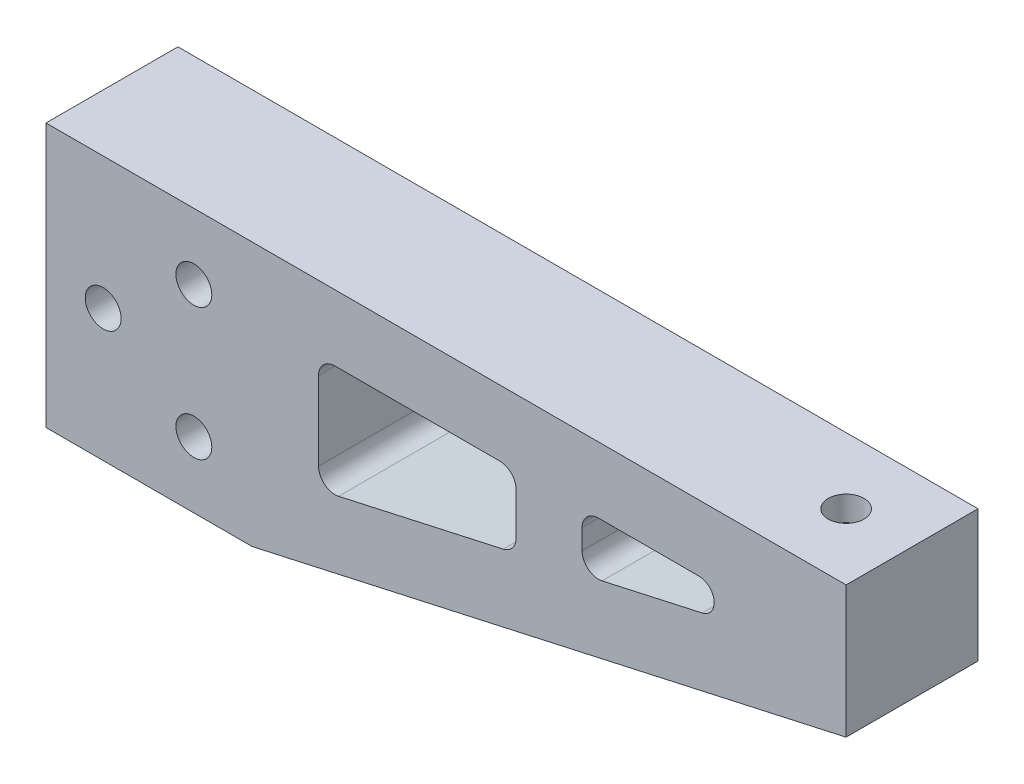
ISO-10303-21;
HEADER;
FILE_DESCRIPTION(('STEP AP214'),'2;1');
FILE_NAME('part.step','',(''),(''),'','','');
FILE_SCHEMA(('AUTOMOTIVE_DESIGN { 1 0 10303 214 1 1 1 1 }'));
ENDSEC;
DATA;
#1=APPLICATION_CONTEXT('core data for automotive mechanical design processes');
#2=APPLICATION_PROTOCOL_DEFINITION('international standard','automotive_design',2000,#1);
#3=PRODUCT_CONTEXT('',#1,'mechanical');
#4=PRODUCT('Part','Part','',(#3));
#5=PRODUCT_RELATED_PRODUCT_CATEGORY('part','',(#4));
#6=PRODUCT_DEFINITION_FORMATION('','',#4);
#7=PRODUCT_DEFINITION_CONTEXT('part definition',#1,'design');
#8=PRODUCT_DEFINITION('design','',#6,#7);
#9=PRODUCT_DEFINITION_SHAPE('','',#8);
#10=(LENGTH_UNIT() NAMED_UNIT(*) SI_UNIT(.MILLI.,.METRE.));
#11=(NAMED_UNIT(*) PLANE_ANGLE_UNIT() SI_UNIT($,.RADIAN.));
#12=(NAMED_UNIT(*) SI_UNIT($,.STERADIAN.) SOLID_ANGLE_UNIT());
#13=UNCERTAINTY_MEASURE_WITH_UNIT(LENGTH_MEASURE(1.E-05),#10,'distance_accuracy_value','');
#14=(GEOMETRIC_REPRESENTATION_CONTEXT(3) GLOBAL_UNCERTAINTY_ASSIGNED_CONTEXT((#13)) GLOBAL_UNIT_ASSIGNED_CONTEXT((#10,
#11,#12)) REPRESENTATION_CONTEXT('',''));
#15=CARTESIAN_POINT('',(0.,0.,0.));
#16=DIRECTION('',(0.,0.,1.));
#17=DIRECTION('',(1.,0.,0.));
#18=AXIS2_PLACEMENT_3D('',#15,#16,#17);
#19=CARTESIAN_POINT('',(-14.1787269469513,4.8712730530487,-6.35));
#20=DIRECTION('',(0.,0.,1.));
#21=DIRECTION('',(1.,0.,0.));
#22=AXIS2_PLACEMENT_3D('',#19,#20,#21);
#23=CYLINDRICAL_SURFACE('',#22,1.4787269469513);
#24=DIRECTION('',(0.,0.,-1.));
#25=VECTOR('',#24,1.);
#26=CARTESIAN_POINT('',(-14.1787269469513,6.35000000000001,-6.35));
#27=LINE('',#26,#25);
#28=CARTESIAN_POINT('',(-14.1787269469513,6.35000000000001,-6.35));
#29=VERTEX_POINT('',#28);
#30=CARTESIAN_POINT('',(-14.1787269469513,6.35000000000001,6.35));
#31=VERTEX_POINT('',#30);
#32=EDGE_CURVE('E298',#29,#31,#27,.F.);
#33=ORIENTED_EDGE('',*,*,#32,.F.);
#34=CARTESIAN_POINT('',(-14.1787269469513,4.8712730530487,-6.35));
#35=DIRECTION('',(0.,0.,-1.));
#36=DIRECTION('',(-1.,0.,0.));
#37=AXIS2_PLACEMENT_3D('',#34,#35,#36);
#38=CIRCLE('',#37,1.4787269469513);
#39=CARTESIAN_POINT('',(-13.8582107474269,3.42770014201083,-6.35));
#40=VERTEX_POINT('',#39);
#41=EDGE_CURVE('E47',#29,#40,#38,.T.);
#42=ORIENTED_EDGE('',*,*,#41,.T.);
#43=DIRECTION('',(0.,0.,-1.));
#44=VECTOR('',#43,1.);
#45=CARTESIAN_POINT('',(-13.8582107474269,3.42770014201083,-6.35));
#46=LINE('',#45,#44);
#47=CARTESIAN_POINT('',(-13.8582107474269,3.42770014201083,6.35));
#48=VERTEX_POINT('',#47);
#49=EDGE_CURVE('E301',#48,#40,#46,.T.);
#50=ORIENTED_EDGE('',*,*,#49,.F.);
#51=CARTESIAN_POINT('',(-14.1787269469513,4.8712730530487,6.35));
#52=DIRECTION('',(0.,0.,-1.));
#53=DIRECTION('',(-1.,0.,0.));
#54=AXIS2_PLACEMENT_3D('',#51,#52,#53);
#55=CIRCLE('',#54,1.4787269469513);
#56=EDGE_CURVE('E12',#48,#31,#55,.F.);
#57=ORIENTED_EDGE('',*,*,#56,.T.);
#58=EDGE_LOOP('',(#33,#42,#50,#57));
#59=FACE_BOUND('',#58,.T.);
#60=ADVANCED_FACE('F39',(#59),#23,.F.);
#61=CARTESIAN_POINT('',(0.,0.,-6.35));
#62=DIRECTION('',(0.,0.,-1.));
#63=DIRECTION('',(-1.,0.,0.));
#64=AXIS2_PLACEMENT_3D('',#61,#62,#63);
#65=PLANE('',#64);
#66=ORIENTED_EDGE('',*,*,#41,.F.);
#67=DIRECTION('',(-1.,0.,0.));
#68=VECTOR('',#67,1.);
#69=CARTESIAN_POINT('',(-25.424765,6.35000000000001,-6.35));
#70=LINE('',#69,#68);
#71=CARTESIAN_POINT('',(-23.837265,6.35000000000001,-6.35));
#72=VERTEX_POINT('',#71);
#73=EDGE_CURVE('E318',#29,#72,#70,.T.);
#74=ORIENTED_EDGE('',*,*,#73,.T.);
#75=CARTESIAN_POINT('',(-23.837265,4.76250000000001,-6.35));
#76=DIRECTION('',(0.,0.,-1.));
#77=DIRECTION('',(-1.,0.,0.));
#78=AXIS2_PLACEMENT_3D('',#75,#76,#77);
#79=CIRCLE('',#78,1.5875);
#80=CARTESIAN_POINT('',(-25.424765,4.76250000000001,-6.35));
#81=VERTEX_POINT('',#80);
#82=EDGE_CURVE('E292',#72,#81,#79,.F.);
#83=ORIENTED_EDGE('',*,*,#82,.T.);
#84=DIRECTION('',(0.,-1.,0.));
#85=VECTOR('',#84,1.);
#86=CARTESIAN_POINT('',(-25.424765,0.859580456277777,-6.35));
#87=LINE('',#86,#85);
#88=CARTESIAN_POINT('',(-25.424765,2.83821172123867,-6.35));
#89=VERTEX_POINT('',#88);
#90=EDGE_CURVE('E315',#81,#89,#87,.T.);
#91=ORIENTED_EDGE('',*,*,#90,.T.);
#92=CARTESIAN_POINT('',(-23.837265,2.83821172123867,-6.35));
#93=DIRECTION('',(0.,0.,-1.));
#94=DIRECTION('',(-1.,0.,0.));
#95=AXIS2_PLACEMENT_3D('',#92,#93,#94);
#96=CIRCLE('',#95,1.5875);
#97=CARTESIAN_POINT('',(-23.49317208427,1.28845163808243,-6.35));
#98=VERTEX_POINT('',#97);
#99=EDGE_CURVE('E296',#89,#98,#96,.F.);
#100=ORIENTED_EDGE('',*,*,#99,.T.);
#101=DIRECTION('',(0.976226824035428,0.216751442979513,0.));
#102=VECTOR('',#101,1.);
#103=CARTESIAN_POINT('',(-12.7,3.68485743844879,-6.35));
#104=LINE('',#103,#102);
#105=EDGE_CURVE('E307',#98,#40,#104,.T.);
#106=ORIENTED_EDGE('',*,*,#105,.T.);
#107=EDGE_LOOP('',(#66,#74,#83,#91,#100,#106));
#108=FACE_BOUND('',#107,.T.);
#109=DIRECTION('',(0.976226824035428,0.216751442979513,0.));
#110=VECTOR('',#109,1.);
#111=CARTESIAN_POINT('',(-31.774765,-0.55030875085382,-6.35));
#112=LINE('',#111,#110);
#113=CARTESIAN_POINT('',(-48.8699960050618,-4.34595941029603,-6.35));
#114=VERTEX_POINT('',#113);
#115=CARTESIAN_POINT('',(-33.01817208427,-0.826382172614966,-6.35));
#116=VERTEX_POINT('',#115);
#117=EDGE_CURVE('E325',#114,#116,#112,.T.);
#118=ORIENTED_EDGE('',*,*,#117,.T.);
#119=CARTESIAN_POINT('',(-33.362265,0.723377910541277,-6.35));
#120=DIRECTION('',(0.,0.,-1.));
#121=DIRECTION('',(-1.,0.,0.));
#122=AXIS2_PLACEMENT_3D('',#119,#120,#121);
#123=CIRCLE('',#122,1.5875);
#124=CARTESIAN_POINT('',(-31.774765,0.723377910541277,-6.35));
#125=VERTEX_POINT('',#124);
#126=EDGE_CURVE('E287',#116,#125,#123,.F.);
#127=ORIENTED_EDGE('',*,*,#126,.T.);
#128=DIRECTION('',(0.,1.,0.));
#129=VECTOR('',#128,1.);
#130=CARTESIAN_POINT('',(-31.774765,6.35000000000001,-6.35));
#131=LINE('',#130,#129);
#132=CARTESIAN_POINT('',(-31.774765,4.76250000000001,-6.35));
#133=VERTEX_POINT('',#132);
#134=EDGE_CURVE('E329',#125,#133,#131,.T.);
#135=ORIENTED_EDGE('',*,*,#134,.T.);
#136=CARTESIAN_POINT('',(-33.362265,4.76250000000001,-6.35));
#137=DIRECTION('',(0.,0.,-1.));
#138=DIRECTION('',(-1.,0.,0.));
#139=AXIS2_PLACEMENT_3D('',#136,#137,#138);
#140=CIRCLE('',#139,1.5875);
#141=CARTESIAN_POINT('',(-33.362265,6.35000000000001,-6.35));
#142=VERTEX_POINT('',#141);
#143=EDGE_CURVE('E283',#133,#142,#140,.F.);
#144=ORIENTED_EDGE('',*,*,#143,.T.);
#145=DIRECTION('',(-1.,0.,0.));
#146=VECTOR('',#145,1.);
#147=CARTESIAN_POINT('',(-50.8015889207918,6.35000000000001,-6.35));
#148=LINE('',#147,#146);
#149=CARTESIAN_POINT('',(-49.2140889207918,6.35000000000001,-6.35));
#150=VERTEX_POINT('',#149);
#151=EDGE_CURVE('E332',#142,#150,#148,.T.);
#152=ORIENTED_EDGE('',*,*,#151,.T.);
#153=CARTESIAN_POINT('',(-49.2140889207918,4.76250000000001,-6.35));
#154=DIRECTION('',(0.,0.,-1.));
#155=DIRECTION('',(-1.,0.,0.));
#156=AXIS2_PLACEMENT_3D('',#153,#154,#155);
#157=CIRCLE('',#156,1.5875);
#158=CARTESIAN_POINT('',(-50.8015889207918,4.76250000000001,-6.35));
#159=VERTEX_POINT('',#158);
#160=EDGE_CURVE('E279',#150,#159,#157,.F.);
#161=ORIENTED_EDGE('',*,*,#160,.T.);
#162=DIRECTION('',(0.,-1.,0.));
#163=VECTOR('',#162,1.);
#164=CARTESIAN_POINT('',(-50.8015889207918,-4.77483059210069,-6.35));
#165=LINE('',#164,#163);
#166=CARTESIAN_POINT('',(-50.8015889207918,-2.79619932713979,-6.35));
#167=VERTEX_POINT('',#166);
#168=EDGE_CURVE('E336',#159,#167,#165,.T.);
#169=ORIENTED_EDGE('',*,*,#168,.T.);
#170=CARTESIAN_POINT('',(-49.2140889207918,-2.79619932713979,-6.35));
#171=DIRECTION('',(0.,0.,-1.));
#172=DIRECTION('',(-1.,0.,0.));
#173=AXIS2_PLACEMENT_3D('',#170,#171,#172);
#174=CIRCLE('',#173,1.5875);
#175=EDGE_CURVE('E275',#167,#114,#174,.F.);
#176=ORIENTED_EDGE('',*,*,#175,.T.);
#177=EDGE_LOOP('',(#118,#127,#135,#144,#152,#161,#169,#176));
#178=FACE_BOUND('',#177,.T.);
#179=DIRECTION('',(0.976226824035428,0.216751442979513,0.));
#180=VECTOR('',#179,1.);
#181=CARTESIAN_POINT('',(-57.19953,-12.7,-6.35));
#182=LINE('',#181,#180);
#183=CARTESIAN_POINT('',(-57.19953,-12.7,-6.35));
#184=VERTEX_POINT('',#183);
#185=CARTESIAN_POINT('',(0.,0.,-6.35));
#186=VERTEX_POINT('',#185);
#187=EDGE_CURVE('E204',#184,#186,#182,.T.);
#188=ORIENTED_EDGE('',*,*,#187,.F.);
#189=DIRECTION('',(1.,0.,0.));
#190=VECTOR('',#189,1.);
#191=CARTESIAN_POINT('',(0.,-12.7,-6.35));
#192=LINE('',#191,#190);
#193=CARTESIAN_POINT('',(-77.04328,-12.7,-6.35));
#194=VERTEX_POINT('',#193);
#195=EDGE_CURVE('E213',#194,#184,#192,.T.);
#196=ORIENTED_EDGE('',*,*,#195,.F.);
#197=DIRECTION('',(0.,-1.,0.));
#198=VECTOR('',#197,1.);
#199=CARTESIAN_POINT('',(-77.04328,12.7,-6.35));
#200=LINE('',#199,#198);
#201=CARTESIAN_POINT('',(-77.04328,12.7,-6.35));
#202=VERTEX_POINT('',#201);
#203=EDGE_CURVE('E233',#202,#194,#200,.T.);
#204=ORIENTED_EDGE('',*,*,#203,.F.);
#205=DIRECTION('',(-1.,0.,0.));
#206=VECTOR('',#205,1.);
#207=CARTESIAN_POINT('',(0.,12.7,-6.35));
#208=LINE('',#207,#206);
#209=CARTESIAN_POINT('',(0.,12.7,-6.35));
#210=VERTEX_POINT('',#209);
#211=EDGE_CURVE('E230',#210,#202,#208,.T.);
#212=ORIENTED_EDGE('',*,*,#211,.F.);
#213=DIRECTION('',(0.,1.,0.));
#214=VECTOR('',#213,1.);
#215=CARTESIAN_POINT('',(0.,12.7,-6.35));
#216=LINE('',#215,#214);
#217=EDGE_CURVE('E228',#186,#210,#216,.T.);
#218=ORIENTED_EDGE('',*,*,#217,.F.);
#219=EDGE_LOOP('',(#188,#196,#204,#212,#218));
#220=FACE_BOUND('',#219,.T.);
#221=CARTESIAN_POINT('',(-62.80658,-6.35000000000018,-6.35));
#222=DIRECTION('',(0.,0.,1.));
#223=DIRECTION('',(1.,0.,0.));
#224=AXIS2_PLACEMENT_3D('',#221,#222,#223);
#225=CIRCLE('',#224,1.7272);
#226=CARTESIAN_POINT('',(-61.07938,-6.35000000000018,-6.35));
#227=VERTEX_POINT('',#226);
#228=EDGE_CURVE('E355',#227,#227,#225,.T.);
#229=ORIENTED_EDGE('',*,*,#228,.T.);
#230=EDGE_LOOP('',(#229));
#231=FACE_BOUND('',#230,.T.);
#232=CARTESIAN_POINT('',(-71.53783,-1.50617572273387E-13,-6.35));
#233=DIRECTION('',(0.,0.,1.));
#234=DIRECTION('',(1.,0.,0.));
#235=AXIS2_PLACEMENT_3D('',#232,#233,#234);
#236=CIRCLE('',#235,1.7272);
#237=CARTESIAN_POINT('',(-69.81063,-1.50617572273387E-13,-6.35));
#238=VERTEX_POINT('',#237);
#239=EDGE_CURVE('E361',#238,#238,#236,.T.);
#240=ORIENTED_EDGE('',*,*,#239,.T.);
#241=EDGE_LOOP('',(#240));
#242=FACE_BOUND('',#241,.T.);
#243=CARTESIAN_POINT('',(-62.80658,6.34999999999982,-6.35));
#244=DIRECTION('',(0.,0.,1.));
#245=DIRECTION('',(1.,0.,0.));
#246=AXIS2_PLACEMENT_3D('',#243,#244,#245);
#247=CIRCLE('',#246,1.7272);
#248=CARTESIAN_POINT('',(-61.07938,6.34999999999982,-6.35));
#249=VERTEX_POINT('',#248);
#250=EDGE_CURVE('E367',#249,#249,#247,.T.);
#251=ORIENTED_EDGE('',*,*,#250,.T.);
#252=EDGE_LOOP('',(#251));
#253=FACE_BOUND('',#252,.T.);
#254=ADVANCED_FACE('F311',(#108,#178,#220,#231,#242,#253),#65,.T.);
#255=CARTESIAN_POINT('',(-9.29875019919063,8.14235000000001,2.94874980080985));
#256=DIRECTION('',(-1.,0.,0.));
#257=DIRECTION('',(0.,-1.,0.));
#258=AXIS2_PLACEMENT_3D('',#255,#256,#257);
#259=PLANE('',#258);
#260=DIRECTION('',(0.,0.,1.));
#261=VECTOR('',#260,1.);
#262=CARTESIAN_POINT('',(-9.29875019919063,10.31875,2.94874980080985));
#263=LINE('',#262,#261);
#264=CARTESIAN_POINT('',(-9.29875019919063,10.31875,-2.94875019919014));
#265=VERTEX_POINT('',#264);
#266=CARTESIAN_POINT('',(-9.29875019919063,10.31875,2.94874980080985));
#267=VERTEX_POINT('',#266);
#268=EDGE_CURVE('E382',#265,#267,#263,.T.);
#269=ORIENTED_EDGE('',*,*,#268,.T.);
#270=DIRECTION('',(0.,1.,0.));
#271=VECTOR('',#270,1.);
#272=CARTESIAN_POINT('',(-9.29875019919063,8.14235000000001,2.94874980080985));
#273=LINE('',#272,#271);
#274=CARTESIAN_POINT('',(-9.29875019919063,8.14235000000001,2.94874980080985));
#275=VERTEX_POINT('',#274);
#276=EDGE_CURVE('E396',#275,#267,#273,.T.);
#277=ORIENTED_EDGE('',*,*,#276,.F.);
#278=DIRECTION('',(0.,0.,1.));
#279=VECTOR('',#278,1.);
#280=CARTESIAN_POINT('',(-9.29875019919063,8.14235000000001,2.94874980080985));
#281=LINE('',#280,#279);
#282=CARTESIAN_POINT('',(-9.29875019919063,8.14235000000001,-2.94875019919014));
#283=VERTEX_POINT('',#282);
#284=EDGE_CURVE('E383',#283,#275,#281,.T.);
#285=ORIENTED_EDGE('',*,*,#284,.F.);
#286=DIRECTION('',(0.,1.,0.));
#287=VECTOR('',#286,1.);
#288=CARTESIAN_POINT('',(-9.29875019919063,8.14235000000001,-2.94875019919014));
#289=LINE('',#288,#287);
#290=EDGE_CURVE('E231',#283,#265,#289,.T.);
#291=ORIENTED_EDGE('',*,*,#290,.T.);
#292=EDGE_LOOP('',(#269,#277,#285,#291));
#293=FACE_BOUND('',#292,.T.);
#294=ADVANCED_FACE('F445',(#293),#259,.F.);
#295=CARTESIAN_POINT('',(-3.40125019919063,8.14235000000001,-2.94875019919015));
#296=DIRECTION('',(0.,0.,-1.));
#297=DIRECTION('',(-1.,0.,0.));
#298=AXIS2_PLACEMENT_3D('',#295,#296,#297);
#299=PLANE('',#298);
#300=DIRECTION('',(-1.,0.,0.));
#301=VECTOR('',#300,1.);
#302=CARTESIAN_POINT('',(-3.40125019919063,10.31875,-2.94875019919015));
#303=LINE('',#302,#301);
#304=CARTESIAN_POINT('',(-3.40125019919063,10.31875,-2.94875019919015));
#305=VERTEX_POINT('',#304);
#306=EDGE_CURVE('E387',#305,#265,#303,.T.);
#307=ORIENTED_EDGE('',*,*,#306,.T.);
#308=ORIENTED_EDGE('',*,*,#290,.F.);
#309=DIRECTION('',(-1.,0.,0.));
#310=VECTOR('',#309,1.);
#311=CARTESIAN_POINT('',(-3.40125019919063,8.14235000000001,-2.94875019919015));
#312=LINE('',#311,#310);
#313=CARTESIAN_POINT('',(-3.40125019919063,8.14235000000001,-2.94875019919015));
#314=VERTEX_POINT('',#313);
#315=EDGE_CURVE('E393',#314,#283,#312,.T.);
#316=ORIENTED_EDGE('',*,*,#315,.F.);
#317=DIRECTION('',(0.,1.,0.));
#318=VECTOR('',#317,1.);
#319=CARTESIAN_POINT('',(-3.40125019919063,8.14235000000001,-2.94875019919015));
#320=LINE('',#319,#318);
#321=EDGE_CURVE('E408',#314,#305,#320,.T.);
#322=ORIENTED_EDGE('',*,*,#321,.T.);
#323=EDGE_LOOP('',(#307,#308,#316,#322));
#324=FACE_BOUND('',#323,.T.);
#325=ADVANCED_FACE('F550',(#324),#299,.F.);
#326=CARTESIAN_POINT('',(-3.40125019919063,8.14235000000001,2.94874980080985));
#327=DIRECTION('',(1.,0.,0.));
#328=DIRECTION('',(0.,1.,0.));
#329=AXIS2_PLACEMENT_3D('',#326,#327,#328);
#330=PLANE('',#329);
#331=DIRECTION('',(0.,0.,-1.));
#332=VECTOR('',#331,1.);
#333=CARTESIAN_POINT('',(-3.40125019919063,10.31875,2.94874980080985));
#334=LINE('',#333,#332);
#335=CARTESIAN_POINT('',(-3.40125019919063,10.31875,2.94874980080985));
#336=VERTEX_POINT('',#335);
#337=EDGE_CURVE('E402',#336,#305,#334,.T.);
#338=ORIENTED_EDGE('',*,*,#337,.T.);
#339=ORIENTED_EDGE('',*,*,#321,.F.);
#340=DIRECTION('',(0.,0.,-1.));
#341=VECTOR('',#340,1.);
#342=CARTESIAN_POINT('',(-3.40125019919063,8.14235000000001,2.94874980080985));
#343=LINE('',#342,#341);
#344=CARTESIAN_POINT('',(-3.40125019919063,8.14235000000001,2.94874980080985));
#345=VERTEX_POINT('',#344);
#346=EDGE_CURVE('E390',#345,#314,#343,.T.);
#347=ORIENTED_EDGE('',*,*,#346,.F.);
#348=DIRECTION('',(0.,1.,0.));
#349=VECTOR('',#348,1.);
#350=CARTESIAN_POINT('',(-3.40125019919063,8.14235000000001,2.94874980080985));
#351=LINE('',#350,#349);
#352=EDGE_CURVE('E410',#345,#336,#351,.T.);
#353=ORIENTED_EDGE('',*,*,#352,.T.);
#354=EDGE_LOOP('',(#338,#339,#347,#353));
#355=FACE_BOUND('',#354,.T.);
#356=ADVANCED_FACE('F553',(#355),#330,.F.);
#357=CARTESIAN_POINT('',(-3.40125019919063,8.14235000000001,2.94874980080985));
#358=DIRECTION('',(0.,0.,1.));
#359=DIRECTION('',(1.,0.,0.));
#360=AXIS2_PLACEMENT_3D('',#357,#358,#359);
#361=PLANE('',#360);
#362=DIRECTION('',(1.,0.,0.));
#363=VECTOR('',#362,1.);
#364=CARTESIAN_POINT('',(-3.40125019919063,10.31875,2.94874980080985));
#365=LINE('',#364,#363);
#366=EDGE_CURVE('E399',#267,#336,#365,.T.);
#367=ORIENTED_EDGE('',*,*,#366,.T.);
#368=ORIENTED_EDGE('',*,*,#352,.F.);
#369=DIRECTION('',(1.,0.,0.));
#370=VECTOR('',#369,1.);
#371=CARTESIAN_POINT('',(-3.40125019919063,8.14235000000001,2.94874980080985));
#372=LINE('',#371,#370);
#373=EDGE_CURVE('E386',#275,#345,#372,.T.);
#374=ORIENTED_EDGE('',*,*,#373,.F.);
#375=ORIENTED_EDGE('',*,*,#276,.T.);
#376=EDGE_LOOP('',(#367,#368,#374,#375));
#377=FACE_BOUND('',#376,.T.);
#378=ADVANCED_FACE('F545',(#377),#361,.F.);
#379=CARTESIAN_POINT('',(0.,8.14235000000001,0.));
#380=DIRECTION('',(0.,1.,0.));
#381=DIRECTION('',(0.,0.,1.));
#382=AXIS2_PLACEMENT_3D('',#379,#380,#381);
#383=PLANE('',#382);
#384=CARTESIAN_POINT('',(-6.35000019919064,8.14235000000001,-1.99190244151715E-07));
#385=DIRECTION('',(0.,1.,0.));
#386=DIRECTION('',(0.,0.,1.));
#387=AXIS2_PLACEMENT_3D('',#384,#385,#386);
#388=CIRCLE('',#387,1.7272);
#389=CARTESIAN_POINT('',(-6.35000019919064,8.14235000000001,1.72719980080976));
#390=VERTEX_POINT('',#389);
#391=EDGE_CURVE('E379',#390,#390,#388,.T.);
#392=ORIENTED_EDGE('',*,*,#391,.F.);
#393=EDGE_LOOP('',(#392));
#394=FACE_BOUND('',#393,.T.);
#395=ORIENTED_EDGE('',*,*,#284,.T.);
#396=ORIENTED_EDGE('',*,*,#373,.T.);
#397=ORIENTED_EDGE('',*,*,#346,.T.);
#398=ORIENTED_EDGE('',*,*,#315,.T.);
#399=EDGE_LOOP('',(#395,#396,#397,#398));
#400=FACE_BOUND('',#399,.T.);
#401=ADVANCED_FACE('F541',(#394,#400),#383,.T.);
#402=CARTESIAN_POINT('',(0.,10.31875,0.));
#403=DIRECTION('',(0.,1.,0.));
#404=DIRECTION('',(0.,0.,1.));
#405=AXIS2_PLACEMENT_3D('',#402,#403,#404);
#406=PLANE('',#405);
#407=CARTESIAN_POINT('',(-6.35000019919064,10.31875,-1.99190244151715E-07));
#408=DIRECTION('',(0.,1.,0.));
#409=DIRECTION('',(0.,0.,1.));
#410=AXIS2_PLACEMENT_3D('',#407,#408,#409);
#411=CIRCLE('',#410,1.7272);
#412=CARTESIAN_POINT('',(-6.35000019919064,10.31875,1.72719980080976));
#413=VERTEX_POINT('',#412);
#414=EDGE_CURVE('E376',#413,#413,#411,.T.);
#415=ORIENTED_EDGE('',*,*,#414,.T.);
#416=EDGE_LOOP('',(#415));
#417=FACE_BOUND('',#416,.T.);
#418=ORIENTED_EDGE('',*,*,#268,.F.);
#419=ORIENTED_EDGE('',*,*,#306,.F.);
#420=ORIENTED_EDGE('',*,*,#337,.F.);
#421=ORIENTED_EDGE('',*,*,#366,.F.);
#422=EDGE_LOOP('',(#418,#419,#420,#421));
#423=FACE_BOUND('',#422,.T.);
#424=ADVANCED_FACE('F544',(#417,#423),#406,.F.);
#425=CARTESIAN_POINT('',(-6.35000019919064,12.7,-1.99190244151715E-07));
#426=DIRECTION('',(0.,1.,0.));
#427=DIRECTION('',(0.,0.,1.));
#428=AXIS2_PLACEMENT_3D('',#425,#426,#427);
#429=CYLINDRICAL_SURFACE('',#428,1.7272);
#430=CARTESIAN_POINT('',(-6.35000019919064,12.7,-1.99190244151715E-07));
#431=DIRECTION('',(0.,1.,0.));
#432=DIRECTION('',(0.,0.,1.));
#433=AXIS2_PLACEMENT_3D('',#430,#431,#432);
#434=CIRCLE('',#433,1.7272);
#435=CARTESIAN_POINT('',(-6.35000019919064,12.7,1.72719980080976));
#436=VERTEX_POINT('',#435);
#437=EDGE_CURVE('E370',#436,#436,#434,.T.);
#438=ORIENTED_EDGE('',*,*,#437,.T.);
#439=EDGE_LOOP('',(#438));
#440=FACE_BOUND('',#439,.T.);
#441=ORIENTED_EDGE('',*,*,#414,.F.);
#442=EDGE_LOOP('',(#441));
#443=FACE_BOUND('',#442,.T.);
#444=ADVANCED_FACE('F439',(#440,#443),#429,.F.);
#445=CARTESIAN_POINT('',(-6.35000019919064,6.35000000000001,-1.99190244151715E-07));
#446=DIRECTION('',(0.,1.,0.));
#447=DIRECTION('',(0.,0.,1.));
#448=AXIS2_PLACEMENT_3D('',#445,#446,#447);
#449=CONICAL_SURFACE('',#448,1.7272,1.02974425867665);
#450=CARTESIAN_POINT('',(-6.35000019919064,5.3121935388156,-1.99190244151715E-07));
#451=VERTEX_POINT('',#450);
#452=VERTEX_LOOP('',#451);
#453=FACE_BOUND('',#452,.T.);
#454=CARTESIAN_POINT('',(-6.35000019919064,6.35000000000001,-1.99190244151715E-07));
#455=DIRECTION('',(0.,1.,0.));
#456=DIRECTION('',(0.,0.,1.));
#457=AXIS2_PLACEMENT_3D('',#454,#455,#456);
#458=CIRCLE('',#457,1.7272);
#459=CARTESIAN_POINT('',(-6.35000019919064,6.35000000000001,1.72719980080975));
#460=VERTEX_POINT('',#459);
#461=EDGE_CURVE('E373',#460,#460,#458,.T.);
#462=ORIENTED_EDGE('',*,*,#461,.T.);
#463=EDGE_LOOP('',(#462));
#464=FACE_BOUND('',#463,.T.);
#465=ADVANCED_FACE('F436',(#453,#464),#449,.F.);
#466=ORIENTED_EDGE('',*,*,#391,.T.);
#467=EDGE_LOOP('',(#466));
#468=FACE_BOUND('',#467,.T.);
#469=ORIENTED_EDGE('',*,*,#461,.F.);
#470=EDGE_LOOP('',(#469));
#471=FACE_BOUND('',#470,.T.);
#472=ADVANCED_FACE('F428',(#468,#471),#429,.F.);
#473=CARTESIAN_POINT('',(0.,12.7,6.35));
#474=DIRECTION('',(-1.,0.,0.));
#475=DIRECTION('',(0.,-1.,0.));
#476=AXIS2_PLACEMENT_3D('',#473,#474,#475);
#477=PLANE('',#476);
#478=DIRECTION('',(0.,1.,0.));
#479=VECTOR('',#478,1.);
#480=CARTESIAN_POINT('',(0.,12.7,6.35));
#481=LINE('',#480,#479);
#482=CARTESIAN_POINT('',(0.,0.,6.35));
#483=VERTEX_POINT('',#482);
#484=CARTESIAN_POINT('',(0.,12.7,6.35));
#485=VERTEX_POINT('',#484);
#486=EDGE_CURVE('E235',#483,#485,#481,.T.);
#487=ORIENTED_EDGE('',*,*,#486,.F.);
#488=DIRECTION('',(0.,0.,-1.));
#489=VECTOR('',#488,1.);
#490=CARTESIAN_POINT('',(0.,0.,6.35));
#491=LINE('',#490,#489);
#492=EDGE_CURVE('E200',#483,#186,#491,.T.);
#493=ORIENTED_EDGE('',*,*,#492,.T.);
#494=ORIENTED_EDGE('',*,*,#217,.T.);
#495=DIRECTION('',(0.,0.,-1.));
#496=VECTOR('',#495,1.);
#497=CARTESIAN_POINT('',(0.,12.7,6.35));
#498=LINE('',#497,#496);
#499=EDGE_CURVE('E239',#485,#210,#498,.T.);
#500=ORIENTED_EDGE('',*,*,#499,.F.);
#501=EDGE_LOOP('',(#487,#493,#494,#500));
#502=FACE_BOUND('',#501,.T.);
#503=ADVANCED_FACE('F426',(#502),#477,.F.);
#504=CARTESIAN_POINT('',(0.,12.7,6.35));
#505=DIRECTION('',(0.,-1.,0.));
#506=DIRECTION('',(1.,0.,0.));
#507=AXIS2_PLACEMENT_3D('',#504,#505,#506);
#508=PLANE('',#507);
#509=ORIENTED_EDGE('',*,*,#437,.F.);
#510=EDGE_LOOP('',(#509));
#511=FACE_BOUND('',#510,.T.);
#512=ORIENTED_EDGE('',*,*,#211,.T.);
#513=DIRECTION('',(0.,0.,-1.));
#514=VECTOR('',#513,1.);
#515=CARTESIAN_POINT('',(-77.04328,12.7,6.35));
#516=LINE('',#515,#514);
#517=CARTESIAN_POINT('',(-77.04328,12.7,6.35));
#518=VERTEX_POINT('',#517);
#519=EDGE_CURVE('E222',#518,#202,#516,.T.);
#520=ORIENTED_EDGE('',*,*,#519,.F.);
#521=DIRECTION('',(-1.,0.,0.));
#522=VECTOR('',#521,1.);
#523=CARTESIAN_POINT('',(0.,12.7,6.35));
#524=LINE('',#523,#522);
#525=EDGE_CURVE('E224',#485,#518,#524,.T.);
#526=ORIENTED_EDGE('',*,*,#525,.F.);
#527=ORIENTED_EDGE('',*,*,#499,.T.);
#528=EDGE_LOOP('',(#512,#520,#526,#527));
#529=FACE_BOUND('',#528,.T.);
#530=ADVANCED_FACE('F417',(#511,#529),#508,.F.);
#531=CARTESIAN_POINT('',(-77.04328,12.7,6.35));
#532=DIRECTION('',(1.,0.,0.));
#533=DIRECTION('',(0.,0.,-1.));
#534=AXIS2_PLACEMENT_3D('',#531,#532,#533);
#535=PLANE('',#534);
#536=ORIENTED_EDGE('',*,*,#203,.T.);
#537=DIRECTION('',(0.,0.,-1.));
#538=VECTOR('',#537,1.);
#539=CARTESIAN_POINT('',(-77.04328,-12.7,6.35));
#540=LINE('',#539,#538);
#541=CARTESIAN_POINT('',(-77.04328,-12.7,6.35));
#542=VERTEX_POINT('',#541);
#543=EDGE_CURVE('E220',#542,#194,#540,.T.);
#544=ORIENTED_EDGE('',*,*,#543,.F.);
#545=DIRECTION('',(0.,-1.,0.));
#546=VECTOR('',#545,1.);
#547=CARTESIAN_POINT('',(-77.04328,12.7,6.35));
#548=LINE('',#547,#546);
#549=EDGE_CURVE('E218',#518,#542,#548,.T.);
#550=ORIENTED_EDGE('',*,*,#549,.F.);
#551=ORIENTED_EDGE('',*,*,#519,.T.);
#552=EDGE_LOOP('',(#536,#544,#550,#551));
#553=FACE_BOUND('',#552,.T.);
#554=ADVANCED_FACE('F421',(#553),#535,.F.);
#555=CARTESIAN_POINT('',(0.,-12.7,6.35));
#556=DIRECTION('',(0.,1.,0.));
#557=DIRECTION('',(-1.,0.,0.));
#558=AXIS2_PLACEMENT_3D('',#555,#556,#557);
#559=PLANE('',#558);
#560=ORIENTED_EDGE('',*,*,#195,.T.);
#561=DIRECTION('',(0.,0.,-1.));
#562=VECTOR('',#561,1.);
#563=CARTESIAN_POINT('',(-57.19953,-12.7,6.35));
#564=LINE('',#563,#562);
#565=CARTESIAN_POINT('',(-57.19953,-12.7,6.35));
#566=VERTEX_POINT('',#565);
#567=EDGE_CURVE('E197',#566,#184,#564,.T.);
#568=ORIENTED_EDGE('',*,*,#567,.F.);
#569=DIRECTION('',(1.,0.,0.));
#570=VECTOR('',#569,1.);
#571=CARTESIAN_POINT('',(0.,-12.7,6.35));
#572=LINE('',#571,#570);
#573=EDGE_CURVE('E211',#542,#566,#572,.T.);
#574=ORIENTED_EDGE('',*,*,#573,.F.);
#575=ORIENTED_EDGE('',*,*,#543,.T.);
#576=EDGE_LOOP('',(#560,#568,#574,#575));
#577=FACE_BOUND('',#576,.T.);
#578=ADVANCED_FACE('F209',(#577),#559,.F.);
#579=CARTESIAN_POINT('',(0.,0.,6.35));
#580=DIRECTION('',(0.,0.,-1.));
#581=DIRECTION('',(-1.,0.,0.));
#582=AXIS2_PLACEMENT_3D('',#579,#580,#581);
#583=PLANE('',#582);
#584=DIRECTION('',(-1.,0.,0.));
#585=VECTOR('',#584,1.);
#586=CARTESIAN_POINT('',(-25.424765,6.35000000000001,6.35));
#587=LINE('',#586,#585);
#588=CARTESIAN_POINT('',(-23.837265,6.35000000000001,6.35));
#589=VERTEX_POINT('',#588);
#590=EDGE_CURVE('E322',#31,#589,#587,.T.);
#591=ORIENTED_EDGE('',*,*,#590,.F.);
#592=ORIENTED_EDGE('',*,*,#56,.F.);
#593=DIRECTION('',(0.976226824035428,0.216751442979513,0.));
#594=VECTOR('',#593,1.);
#595=CARTESIAN_POINT('',(-12.7,3.68485743844879,6.35));
#596=LINE('',#595,#594);
#597=CARTESIAN_POINT('',(-23.49317208427,1.28845163808243,6.35));
#598=VERTEX_POINT('',#597);
#599=EDGE_CURVE('E309',#598,#48,#596,.T.);
#600=ORIENTED_EDGE('',*,*,#599,.F.);
#601=CARTESIAN_POINT('',(-23.837265,2.83821172123867,6.35));
#602=DIRECTION('',(0.,0.,-1.));
#603=DIRECTION('',(-1.,0.,0.));
#604=AXIS2_PLACEMENT_3D('',#601,#602,#603);
#605=CIRCLE('',#604,1.5875);
#606=CARTESIAN_POINT('',(-25.424765,2.83821172123867,6.35));
#607=VERTEX_POINT('',#606);
#608=EDGE_CURVE('E294',#598,#607,#605,.T.);
#609=ORIENTED_EDGE('',*,*,#608,.T.);
#610=DIRECTION('',(0.,-1.,0.));
#611=VECTOR('',#610,1.);
#612=CARTESIAN_POINT('',(-25.424765,0.859580456277777,6.35));
#613=LINE('',#612,#611);
#614=CARTESIAN_POINT('',(-25.424765,4.76250000000001,6.35));
#615=VERTEX_POINT('',#614);
#616=EDGE_CURVE('E324',#615,#607,#613,.T.);
#617=ORIENTED_EDGE('',*,*,#616,.F.);
#618=CARTESIAN_POINT('',(-23.837265,4.76250000000001,6.35));
#619=DIRECTION('',(0.,0.,-1.));
#620=DIRECTION('',(-1.,0.,0.));
#621=AXIS2_PLACEMENT_3D('',#618,#619,#620);
#622=CIRCLE('',#621,1.5875);
#623=EDGE_CURVE('E289',#615,#589,#622,.T.);
#624=ORIENTED_EDGE('',*,*,#623,.T.);
#625=EDGE_LOOP('',(#591,#592,#600,#609,#617,#624));
#626=FACE_BOUND('',#625,.T.);
#627=DIRECTION('',(-1.,0.,0.));
#628=VECTOR('',#627,1.);
#629=CARTESIAN_POINT('',(-50.8015889207918,6.35000000000001,6.35));
#630=LINE('',#629,#628);
#631=CARTESIAN_POINT('',(-33.362265,6.35000000000001,6.35));
#632=VERTEX_POINT('',#631);
#633=CARTESIAN_POINT('',(-49.2140889207918,6.35000000000001,6.35));
#634=VERTEX_POINT('',#633);
#635=EDGE_CURVE('E344',#632,#634,#630,.T.);
#636=ORIENTED_EDGE('',*,*,#635,.F.);
#637=CARTESIAN_POINT('',(-33.362265,4.76250000000001,6.35));
#638=DIRECTION('',(0.,0.,-1.));
#639=DIRECTION('',(-1.,0.,0.));
#640=AXIS2_PLACEMENT_3D('',#637,#638,#639);
#641=CIRCLE('',#640,1.5875);
#642=CARTESIAN_POINT('',(-31.774765,4.76250000000001,6.35));
#643=VERTEX_POINT('',#642);
#644=EDGE_CURVE('E281',#632,#643,#641,.T.);
#645=ORIENTED_EDGE('',*,*,#644,.T.);
#646=DIRECTION('',(0.,1.,0.));
#647=VECTOR('',#646,1.);
#648=CARTESIAN_POINT('',(-31.774765,6.35000000000001,6.35));
#649=LINE('',#648,#647);
#650=CARTESIAN_POINT('',(-31.774765,0.723377910541277,6.35));
#651=VERTEX_POINT('',#650);
#652=EDGE_CURVE('E341',#651,#643,#649,.T.);
#653=ORIENTED_EDGE('',*,*,#652,.F.);
#654=CARTESIAN_POINT('',(-33.362265,0.723377910541277,6.35));
#655=DIRECTION('',(0.,0.,-1.));
#656=DIRECTION('',(-1.,0.,0.));
#657=AXIS2_PLACEMENT_3D('',#654,#655,#656);
#658=CIRCLE('',#657,1.5875);
#659=CARTESIAN_POINT('',(-33.01817208427,-0.826382172614966,6.35));
#660=VERTEX_POINT('',#659);
#661=EDGE_CURVE('E285',#651,#660,#658,.T.);
#662=ORIENTED_EDGE('',*,*,#661,.T.);
#663=DIRECTION('',(0.976226824035428,0.216751442979513,0.));
#664=VECTOR('',#663,1.);
#665=CARTESIAN_POINT('',(-31.774765,-0.55030875085382,6.35));
#666=LINE('',#665,#664);
#667=CARTESIAN_POINT('',(-48.8699960050618,-4.34595941029603,6.35));
#668=VERTEX_POINT('',#667);
#669=EDGE_CURVE('E333',#668,#660,#666,.T.);
#670=ORIENTED_EDGE('',*,*,#669,.F.);
#671=CARTESIAN_POINT('',(-49.2140889207918,-2.79619932713979,6.35));
#672=DIRECTION('',(0.,0.,-1.));
#673=DIRECTION('',(-1.,0.,0.));
#674=AXIS2_PLACEMENT_3D('',#671,#672,#673);
#675=CIRCLE('',#674,1.5875);
#676=CARTESIAN_POINT('',(-50.8015889207918,-2.79619932713979,6.35));
#677=VERTEX_POINT('',#676);
#678=EDGE_CURVE('E273',#668,#677,#675,.T.);
#679=ORIENTED_EDGE('',*,*,#678,.T.);
#680=DIRECTION('',(0.,-1.,0.));
#681=VECTOR('',#680,1.);
#682=CARTESIAN_POINT('',(-50.8015889207918,-4.77483059210069,6.35));
#683=LINE('',#682,#681);
#684=CARTESIAN_POINT('',(-50.8015889207918,4.76250000000001,6.35));
#685=VERTEX_POINT('',#684);
#686=EDGE_CURVE('E347',#685,#677,#683,.T.);
#687=ORIENTED_EDGE('',*,*,#686,.F.);
#688=CARTESIAN_POINT('',(-49.2140889207918,4.76250000000001,6.35));
#689=DIRECTION('',(0.,0.,-1.));
#690=DIRECTION('',(-1.,0.,0.));
#691=AXIS2_PLACEMENT_3D('',#688,#689,#690);
#692=CIRCLE('',#691,1.5875);
#693=EDGE_CURVE('E277',#685,#634,#692,.T.);
#694=ORIENTED_EDGE('',*,*,#693,.T.);
#695=EDGE_LOOP('',(#636,#645,#653,#662,#670,#679,#687,#694));
#696=FACE_BOUND('',#695,.T.);
#697=CARTESIAN_POINT('',(-62.80658,-6.35000000000018,6.35));
#698=DIRECTION('',(0.,0.,1.));
#699=DIRECTION('',(1.,0.,0.));
#700=AXIS2_PLACEMENT_3D('',#697,#698,#699);
#701=CIRCLE('',#700,1.72719999999998);
#702=CARTESIAN_POINT('',(-61.07938,-6.35000000000018,6.35));
#703=VERTEX_POINT('',#702);
#704=EDGE_CURVE('E214',#703,#703,#701,.T.);
#705=ORIENTED_EDGE('',*,*,#704,.F.);
#706=EDGE_LOOP('',(#705));
#707=FACE_BOUND('',#706,.T.);
#708=CARTESIAN_POINT('',(-71.53783,-1.50617572273387E-13,6.35));
#709=DIRECTION('',(0.,0.,1.));
#710=DIRECTION('',(1.,0.,0.));
#711=AXIS2_PLACEMENT_3D('',#708,#709,#710);
#712=CIRCLE('',#711,1.72719999999998);
#713=CARTESIAN_POINT('',(-69.81063,-1.50617572273387E-13,6.35));
#714=VERTEX_POINT('',#713);
#715=EDGE_CURVE('E358',#714,#714,#712,.T.);
#716=ORIENTED_EDGE('',*,*,#715,.F.);
#717=EDGE_LOOP('',(#716));
#718=FACE_BOUND('',#717,.T.);
#719=CARTESIAN_POINT('',(-62.80658,6.34999999999982,6.35));
#720=DIRECTION('',(0.,0.,1.));
#721=DIRECTION('',(1.,0.,0.));
#722=AXIS2_PLACEMENT_3D('',#719,#720,#721);
#723=CIRCLE('',#722,1.72719999999998);
#724=CARTESIAN_POINT('',(-61.07938,6.34999999999982,6.35));
#725=VERTEX_POINT('',#724);
#726=EDGE_CURVE('E364',#725,#725,#723,.T.);
#727=ORIENTED_EDGE('',*,*,#726,.F.);
#728=EDGE_LOOP('',(#727));
#729=FACE_BOUND('',#728,.T.);
#730=ORIENTED_EDGE('',*,*,#573,.T.);
#731=DIRECTION('',(0.976226824035428,0.216751442979513,0.));
#732=VECTOR('',#731,1.);
#733=CARTESIAN_POINT('',(-57.19953,-12.7,6.35));
#734=LINE('',#733,#732);
#735=EDGE_CURVE('E194',#566,#483,#734,.T.);
#736=ORIENTED_EDGE('',*,*,#735,.T.);
#737=ORIENTED_EDGE('',*,*,#486,.T.);
#738=ORIENTED_EDGE('',*,*,#525,.T.);
#739=ORIENTED_EDGE('',*,*,#549,.T.);
#740=EDGE_LOOP('',(#730,#736,#737,#738,#739));
#741=FACE_BOUND('',#740,.T.);
#742=ADVANCED_FACE('F216',(#626,#696,#707,#718,#729,#741),#583,.F.);
#743=CARTESIAN_POINT('',(-62.80658,6.34999999999982,6.35));
#744=DIRECTION('',(0.,0.,1.));
#745=DIRECTION('',(1.,0.,0.));
#746=AXIS2_PLACEMENT_3D('',#743,#744,#745);
#747=CYLINDRICAL_SURFACE('',#746,1.72719999999999);
#748=ORIENTED_EDGE('',*,*,#250,.F.);
#749=EDGE_LOOP('',(#748));
#750=FACE_BOUND('',#749,.T.);
#751=ORIENTED_EDGE('',*,*,#726,.T.);
#752=EDGE_LOOP('',(#751));
#753=FACE_BOUND('',#752,.T.);
#754=ADVANCED_FACE('F517',(#750,#753),#747,.F.);
#755=CARTESIAN_POINT('',(-71.53783,-1.50617572273387E-13,6.35));
#756=DIRECTION('',(0.,0.,1.));
#757=DIRECTION('',(1.,0.,0.));
#758=AXIS2_PLACEMENT_3D('',#755,#756,#757);
#759=CYLINDRICAL_SURFACE('',#758,1.72719999999999);
#760=ORIENTED_EDGE('',*,*,#239,.F.);
#761=EDGE_LOOP('',(#760));
#762=FACE_BOUND('',#761,.T.);
#763=ORIENTED_EDGE('',*,*,#715,.T.);
#764=EDGE_LOOP('',(#763));
#765=FACE_BOUND('',#764,.T.);
#766=ADVANCED_FACE('F526',(#762,#765),#759,.F.);
#767=CARTESIAN_POINT('',(-62.80658,-6.35000000000018,6.35));
#768=DIRECTION('',(0.,0.,1.));
#769=DIRECTION('',(1.,0.,0.));
#770=AXIS2_PLACEMENT_3D('',#767,#768,#769);
#771=CYLINDRICAL_SURFACE('',#770,1.72719999999999);
#772=ORIENTED_EDGE('',*,*,#228,.F.);
#773=EDGE_LOOP('',(#772));
#774=FACE_BOUND('',#773,.T.);
#775=ORIENTED_EDGE('',*,*,#704,.T.);
#776=EDGE_LOOP('',(#775));
#777=FACE_BOUND('',#776,.T.);
#778=ADVANCED_FACE('F532',(#774,#777),#771,.F.);
#779=CARTESIAN_POINT('',(-57.19953,-12.7,6.35));
#780=DIRECTION('',(-0.216751442979513,0.976226824035428,0.));
#781=DIRECTION('',(-0.976226824035428,-0.216751442979513,0.));
#782=AXIS2_PLACEMENT_3D('',#779,#780,#781);
#783=PLANE('',#782);
#784=ORIENTED_EDGE('',*,*,#187,.T.);
#785=ORIENTED_EDGE('',*,*,#492,.F.);
#786=ORIENTED_EDGE('',*,*,#735,.F.);
#787=ORIENTED_EDGE('',*,*,#567,.T.);
#788=EDGE_LOOP('',(#784,#785,#786,#787));
#789=FACE_BOUND('',#788,.T.);
#790=ADVANCED_FACE('F196',(#789),#783,.F.);
#791=CARTESIAN_POINT('',(-31.774765,6.35000000000001,-6.35));
#792=DIRECTION('',(1.,0.,0.));
#793=DIRECTION('',(0.,0.,-1.));
#794=AXIS2_PLACEMENT_3D('',#791,#792,#793);
#795=PLANE('',#794);
#796=ORIENTED_EDGE('',*,*,#652,.T.);
#797=DIRECTION('',(0.,0.,1.));
#798=VECTOR('',#797,1.);
#799=CARTESIAN_POINT('',(-31.774765,4.76250000000001,-6.35));
#800=LINE('',#799,#798);
#801=EDGE_CURVE('E260',#643,#133,#800,.F.);
#802=ORIENTED_EDGE('',*,*,#801,.T.);
#803=ORIENTED_EDGE('',*,*,#134,.F.);
#804=DIRECTION('',(0.,0.,1.));
#805=VECTOR('',#804,1.);
#806=CARTESIAN_POINT('',(-31.774765,0.723377910541277,6.35));
#807=LINE('',#806,#805);
#808=EDGE_CURVE('E257',#125,#651,#807,.T.);
#809=ORIENTED_EDGE('',*,*,#808,.T.);
#810=EDGE_LOOP('',(#796,#802,#803,#809));
#811=FACE_BOUND('',#810,.T.);
#812=ADVANCED_FACE('F501',(#811),#795,.F.);
#813=CARTESIAN_POINT('',(-31.774765,-0.55030875085382,-6.35));
#814=DIRECTION('',(0.216751442979513,-0.976226824035428,0.));
#815=DIRECTION('',(0.976226824035428,0.216751442979513,0.));
#816=AXIS2_PLACEMENT_3D('',#813,#814,#815);
#817=PLANE('',#816);
#818=ORIENTED_EDGE('',*,*,#117,.F.);
#819=DIRECTION('',(0.,0.,1.));
#820=VECTOR('',#819,1.);
#821=CARTESIAN_POINT('',(-48.8699960050618,-4.34595941029603,6.35));
#822=LINE('',#821,#820);
#823=EDGE_CURVE('E244',#114,#668,#822,.T.);
#824=ORIENTED_EDGE('',*,*,#823,.T.);
#825=ORIENTED_EDGE('',*,*,#669,.T.);
#826=DIRECTION('',(0.,0.,1.));
#827=VECTOR('',#826,1.);
#828=CARTESIAN_POINT('',(-33.01817208427,-0.826382172614965,-6.35));
#829=LINE('',#828,#827);
#830=EDGE_CURVE('E242',#660,#116,#829,.F.);
#831=ORIENTED_EDGE('',*,*,#830,.T.);
#832=EDGE_LOOP('',(#818,#824,#825,#831));
#833=FACE_BOUND('',#832,.T.);
#834=ADVANCED_FACE('F494',(#833),#817,.F.);
#835=CARTESIAN_POINT('',(-50.8015889207918,-4.77483059210069,-6.35));
#836=DIRECTION('',(-1.,0.,0.));
#837=DIRECTION('',(0.,0.,1.));
#838=AXIS2_PLACEMENT_3D('',#835,#836,#837);
#839=PLANE('',#838);
#840=ORIENTED_EDGE('',*,*,#686,.T.);
#841=DIRECTION('',(0.,0.,1.));
#842=VECTOR('',#841,1.);
#843=CARTESIAN_POINT('',(-50.8015889207918,-2.79619932713979,-6.35));
#844=LINE('',#843,#842);
#845=EDGE_CURVE('E250',#677,#167,#844,.F.);
#846=ORIENTED_EDGE('',*,*,#845,.T.);
#847=ORIENTED_EDGE('',*,*,#168,.F.);
#848=DIRECTION('',(0.,0.,1.));
#849=VECTOR('',#848,1.);
#850=CARTESIAN_POINT('',(-50.8015889207918,4.76250000000001,6.35));
#851=LINE('',#850,#849);
#852=EDGE_CURVE('E247',#159,#685,#851,.T.);
#853=ORIENTED_EDGE('',*,*,#852,.T.);
#854=EDGE_LOOP('',(#840,#846,#847,#853));
#855=FACE_BOUND('',#854,.T.);
#856=ADVANCED_FACE('F513',(#855),#839,.F.);
#857=CARTESIAN_POINT('',(-50.8015889207918,6.35000000000001,-6.35));
#858=DIRECTION('',(0.,1.,0.));
#859=DIRECTION('',(0.,0.,1.));
#860=AXIS2_PLACEMENT_3D('',#857,#858,#859);
#861=PLANE('',#860);
#862=ORIENTED_EDGE('',*,*,#635,.T.);
#863=DIRECTION('',(0.,0.,1.));
#864=VECTOR('',#863,1.);
#865=CARTESIAN_POINT('',(-49.2140889207918,6.35000000000001,-6.35));
#866=LINE('',#865,#864);
#867=EDGE_CURVE('E255',#634,#150,#866,.F.);
#868=ORIENTED_EDGE('',*,*,#867,.T.);
#869=ORIENTED_EDGE('',*,*,#151,.F.);
#870=DIRECTION('',(0.,0.,1.));
#871=VECTOR('',#870,1.);
#872=CARTESIAN_POINT('',(-33.362265,6.35000000000001,6.35));
#873=LINE('',#872,#871);
#874=EDGE_CURVE('E252',#142,#632,#873,.T.);
#875=ORIENTED_EDGE('',*,*,#874,.T.);
#876=EDGE_LOOP('',(#862,#868,#869,#875));
#877=FACE_BOUND('',#876,.T.);
#878=ADVANCED_FACE('F508',(#877),#861,.F.);
#879=CARTESIAN_POINT('',(-12.7,3.68485743844879,-6.35));
#880=DIRECTION('',(0.216751442979513,-0.976226824035428,0.));
#881=DIRECTION('',(0.976226824035428,0.216751442979513,0.));
#882=AXIS2_PLACEMENT_3D('',#879,#880,#881);
#883=PLANE('',#882);
#884=ORIENTED_EDGE('',*,*,#599,.T.);
#885=ORIENTED_EDGE('',*,*,#49,.T.);
#886=ORIENTED_EDGE('',*,*,#105,.F.);
#887=DIRECTION('',(0.,0.,1.));
#888=VECTOR('',#887,1.);
#889=CARTESIAN_POINT('',(-23.49317208427,1.28845163808243,6.35));
#890=LINE('',#889,#888);
#891=EDGE_CURVE('E270',#98,#598,#890,.T.);
#892=ORIENTED_EDGE('',*,*,#891,.T.);
#893=EDGE_LOOP('',(#884,#885,#886,#892));
#894=FACE_BOUND('',#893,.T.);
#895=ADVANCED_FACE('F306',(#894),#883,.F.);
#896=CARTESIAN_POINT('',(-25.424765,0.859580456277777,-6.35));
#897=DIRECTION('',(-1.,0.,0.));
#898=DIRECTION('',(0.,0.,1.));
#899=AXIS2_PLACEMENT_3D('',#896,#897,#898);
#900=PLANE('',#899);
#901=ORIENTED_EDGE('',*,*,#90,.F.);
#902=DIRECTION('',(0.,0.,1.));
#903=VECTOR('',#902,1.);
#904=CARTESIAN_POINT('',(-25.424765,4.76250000000001,6.35));
#905=LINE('',#904,#903);
#906=EDGE_CURVE('E264',#81,#615,#905,.T.);
#907=ORIENTED_EDGE('',*,*,#906,.T.);
#908=ORIENTED_EDGE('',*,*,#616,.T.);
#909=DIRECTION('',(0.,0.,1.));
#910=VECTOR('',#909,1.);
#911=CARTESIAN_POINT('',(-25.424765,2.83821172123867,-6.35));
#912=LINE('',#911,#910);
#913=EDGE_CURVE('E262',#607,#89,#912,.F.);
#914=ORIENTED_EDGE('',*,*,#913,.T.);
#915=EDGE_LOOP('',(#901,#907,#908,#914));
#916=FACE_BOUND('',#915,.T.);
#917=ADVANCED_FACE('F456',(#916),#900,.F.);
#918=CARTESIAN_POINT('',(-25.424765,6.35000000000001,-6.35));
#919=DIRECTION('',(0.,1.,0.));
#920=DIRECTION('',(0.,0.,1.));
#921=AXIS2_PLACEMENT_3D('',#918,#919,#920);
#922=PLANE('',#921);
#923=ORIENTED_EDGE('',*,*,#73,.F.);
#924=ORIENTED_EDGE('',*,*,#32,.T.);
#925=ORIENTED_EDGE('',*,*,#590,.T.);
#926=DIRECTION('',(0.,0.,1.));
#927=VECTOR('',#926,1.);
#928=CARTESIAN_POINT('',(-23.837265,6.35000000000001,-6.35));
#929=LINE('',#928,#927);
#930=EDGE_CURVE('E267',#589,#72,#929,.F.);
#931=ORIENTED_EDGE('',*,*,#930,.T.);
#932=EDGE_LOOP('',(#923,#924,#925,#931));
#933=FACE_BOUND('',#932,.T.);
#934=ADVANCED_FACE('F449',(#933),#922,.F.);
#935=CARTESIAN_POINT('',(-49.2140889207918,-2.79619932713979,-6.35));
#936=DIRECTION('',(0.,0.,-1.));
#937=DIRECTION('',(-1.,0.,0.));
#938=AXIS2_PLACEMENT_3D('',#935,#936,#937);
#939=CYLINDRICAL_SURFACE('',#938,1.5875);
#940=ORIENTED_EDGE('',*,*,#175,.F.);
#941=ORIENTED_EDGE('',*,*,#845,.F.);
#942=ORIENTED_EDGE('',*,*,#678,.F.);
#943=ORIENTED_EDGE('',*,*,#823,.F.);
#944=EDGE_LOOP('',(#940,#941,#942,#943));
#945=FACE_BOUND('',#944,.T.);
#946=ADVANCED_FACE('F479',(#945),#939,.F.);
#947=CARTESIAN_POINT('',(-49.2140889207918,4.76250000000001,-6.35));
#948=DIRECTION('',(0.,0.,-1.));
#949=DIRECTION('',(-1.,0.,0.));
#950=AXIS2_PLACEMENT_3D('',#947,#948,#949);
#951=CYLINDRICAL_SURFACE('',#950,1.5875);
#952=ORIENTED_EDGE('',*,*,#160,.F.);
#953=ORIENTED_EDGE('',*,*,#867,.F.);
#954=ORIENTED_EDGE('',*,*,#693,.F.);
#955=ORIENTED_EDGE('',*,*,#852,.F.);
#956=EDGE_LOOP('',(#952,#953,#954,#955));
#957=FACE_BOUND('',#956,.T.);
#958=ADVANCED_FACE('F476',(#957),#951,.F.);
#959=CARTESIAN_POINT('',(-33.362265,4.76250000000001,-6.35));
#960=DIRECTION('',(0.,0.,-1.));
#961=DIRECTION('',(-1.,0.,0.));
#962=AXIS2_PLACEMENT_3D('',#959,#960,#961);
#963=CYLINDRICAL_SURFACE('',#962,1.5875);
#964=ORIENTED_EDGE('',*,*,#143,.F.);
#965=ORIENTED_EDGE('',*,*,#801,.F.);
#966=ORIENTED_EDGE('',*,*,#644,.F.);
#967=ORIENTED_EDGE('',*,*,#874,.F.);
#968=EDGE_LOOP('',(#964,#965,#966,#967));
#969=FACE_BOUND('',#968,.T.);
#970=ADVANCED_FACE('F472',(#969),#963,.F.);
#971=CARTESIAN_POINT('',(-33.362265,0.723377910541277,-6.35));
#972=DIRECTION('',(0.,0.,-1.));
#973=DIRECTION('',(-1.,0.,0.));
#974=AXIS2_PLACEMENT_3D('',#971,#972,#973);
#975=CYLINDRICAL_SURFACE('',#974,1.5875);
#976=ORIENTED_EDGE('',*,*,#126,.F.);
#977=ORIENTED_EDGE('',*,*,#830,.F.);
#978=ORIENTED_EDGE('',*,*,#661,.F.);
#979=ORIENTED_EDGE('',*,*,#808,.F.);
#980=EDGE_LOOP('',(#976,#977,#978,#979));
#981=FACE_BOUND('',#980,.T.);
#982=ADVANCED_FACE('F467',(#981),#975,.F.);
#983=CARTESIAN_POINT('',(-23.837265,4.76250000000001,-6.35));
#984=DIRECTION('',(0.,0.,-1.));
#985=DIRECTION('',(-1.,0.,0.));
#986=AXIS2_PLACEMENT_3D('',#983,#984,#985);
#987=CYLINDRICAL_SURFACE('',#986,1.5875);
#988=ORIENTED_EDGE('',*,*,#82,.F.);
#989=ORIENTED_EDGE('',*,*,#930,.F.);
#990=ORIENTED_EDGE('',*,*,#623,.F.);
#991=ORIENTED_EDGE('',*,*,#906,.F.);
#992=EDGE_LOOP('',(#988,#989,#990,#991));
#993=FACE_BOUND('',#992,.T.);
#994=ADVANCED_FACE('F459',(#993),#987,.F.);
#995=CARTESIAN_POINT('',(-23.837265,2.83821172123867,-6.35));
#996=DIRECTION('',(0.,0.,-1.));
#997=DIRECTION('',(-1.,0.,0.));
#998=AXIS2_PLACEMENT_3D('',#995,#996,#997);
#999=CYLINDRICAL_SURFACE('',#998,1.5875);
#1000=ORIENTED_EDGE('',*,*,#99,.F.);
#1001=ORIENTED_EDGE('',*,*,#913,.F.);
#1002=ORIENTED_EDGE('',*,*,#608,.F.);
#1003=ORIENTED_EDGE('',*,*,#891,.F.);
#1004=EDGE_LOOP('',(#1000,#1001,#1002,#1003));
#1005=FACE_BOUND('',#1004,.T.);
#1006=ADVANCED_FACE('F462',(#1005),#999,.F.);
#1007=CLOSED_SHELL('',(#60,#254,#294,#325,#356,#378,#401,#424,#444,#465,#472,#503,#530,#554,
#578,#742,#754,#766,#778,#790,#812,#834,#856,#878,#895,#917,#934,#946,#958,#970,#982,#994,#1006));
#1008=MANIFOLD_SOLID_BREP('B2',#1007);
#1009=ADVANCED_BREP_SHAPE_REPRESENTATION('',(#18,#1008),#14);
#1010=SHAPE_DEFINITION_REPRESENTATION(#9,#1009);
ENDSEC;
END-ISO-10303-21;
